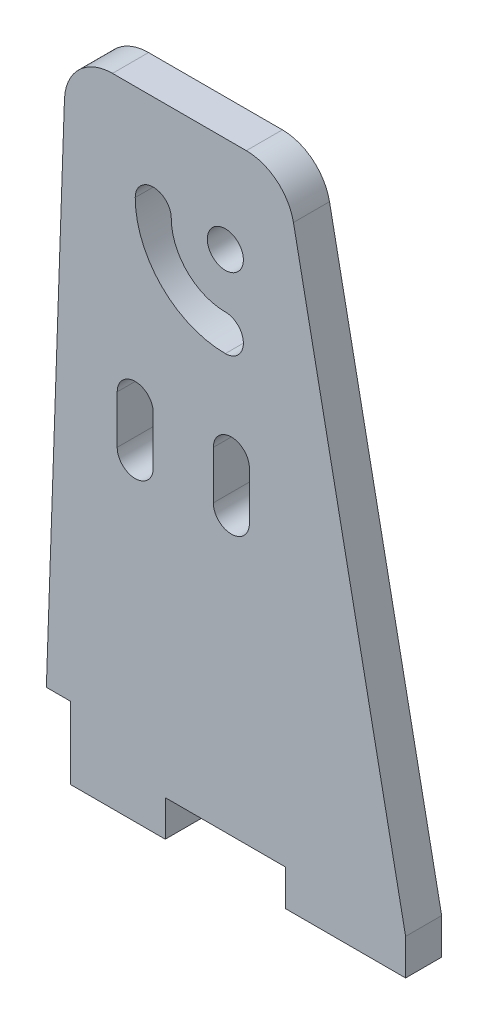
ISO-10303-21;
HEADER;
FILE_DESCRIPTION(('STEP AP214'),'2;1');
FILE_NAME('part.step','',(''),(''),'','','');
FILE_SCHEMA(('AUTOMOTIVE_DESIGN { 1 0 10303 214 1 1 1 1 }'));
ENDSEC;
DATA;
#1=APPLICATION_CONTEXT('core data for automotive mechanical design processes');
#2=APPLICATION_PROTOCOL_DEFINITION('international standard','automotive_design',2000,#1);
#3=PRODUCT_CONTEXT('',#1,'mechanical');
#4=PRODUCT('Part','Part','',(#3));
#5=PRODUCT_RELATED_PRODUCT_CATEGORY('part','',(#4));
#6=PRODUCT_DEFINITION_FORMATION('','',#4);
#7=PRODUCT_DEFINITION_CONTEXT('part definition',#1,'design');
#8=PRODUCT_DEFINITION('design','',#6,#7);
#9=PRODUCT_DEFINITION_SHAPE('','',#8);
#10=(LENGTH_UNIT() NAMED_UNIT(*) SI_UNIT(.MILLI.,.METRE.));
#11=(NAMED_UNIT(*) PLANE_ANGLE_UNIT() SI_UNIT($,.RADIAN.));
#12=(NAMED_UNIT(*) SI_UNIT($,.STERADIAN.) SOLID_ANGLE_UNIT());
#13=UNCERTAINTY_MEASURE_WITH_UNIT(LENGTH_MEASURE(1.E-05),#10,'distance_accuracy_value','');
#14=(GEOMETRIC_REPRESENTATION_CONTEXT(3) GLOBAL_UNCERTAINTY_ASSIGNED_CONTEXT((#13)) GLOBAL_UNIT_ASSIGNED_CONTEXT((#10,
#11,#12)) REPRESENTATION_CONTEXT('',''));
#15=CARTESIAN_POINT('',(0.,0.,0.));
#16=DIRECTION('',(0.,0.,1.));
#17=DIRECTION('',(1.,0.,0.));
#18=AXIS2_PLACEMENT_3D('',#15,#16,#17);
#19=CARTESIAN_POINT('',(-30.8398045570258,22.8317757009346,3.));
#20=DIRECTION('',(0.,0.,-1.));
#21=DIRECTION('',(-1.,0.,0.));
#22=AXIS2_PLACEMENT_3D('',#19,#20,#21);
#23=PLANE('',#22);
#24=CARTESIAN_POINT('',(-28.9485981308411,4.07426117640597,3.));
#25=DIRECTION('',(0.,0.,1.));
#26=DIRECTION('',(1.,0.,0.));
#27=AXIS2_PLACEMENT_3D('',#24,#25,#26);
#28=CIRCLE('',#27,1.5);
#29=CARTESIAN_POINT('',(-27.4485981308411,4.07426117640597,3.));
#30=VERTEX_POINT('',#29);
#31=CARTESIAN_POINT('',(-30.4485981308411,4.07426117640597,3.));
#32=VERTEX_POINT('',#31);
#33=EDGE_CURVE('E256',#30,#32,#28,.T.);
#34=ORIENTED_EDGE('',*,*,#33,.F.);
#35=DIRECTION('',(0.,1.,0.));
#36=VECTOR('',#35,1.);
#37=CARTESIAN_POINT('',(-27.4485981308411,4.07426117640597,3.));
#38=LINE('',#37,#36);
#39=CARTESIAN_POINT('',(-27.4485981308411,0.0742611764059688,3.));
#40=VERTEX_POINT('',#39);
#41=EDGE_CURVE('E264',#40,#30,#38,.T.);
#42=ORIENTED_EDGE('',*,*,#41,.F.);
#43=CARTESIAN_POINT('',(-28.9485981308411,0.0742611764059688,3.));
#44=DIRECTION('',(0.,0.,1.));
#45=DIRECTION('',(1.,0.,0.));
#46=AXIS2_PLACEMENT_3D('',#43,#44,#45);
#47=CIRCLE('',#46,1.5);
#48=CARTESIAN_POINT('',(-30.4485981308411,0.074261176405969,3.));
#49=VERTEX_POINT('',#48);
#50=EDGE_CURVE('E261',#49,#40,#47,.T.);
#51=ORIENTED_EDGE('',*,*,#50,.F.);
#52=DIRECTION('',(0.,-1.,0.));
#53=VECTOR('',#52,1.);
#54=CARTESIAN_POINT('',(-30.4485981308411,4.07426117640597,3.));
#55=LINE('',#54,#53);
#56=EDGE_CURVE('E258',#32,#49,#55,.T.);
#57=ORIENTED_EDGE('',*,*,#56,.F.);
#58=EDGE_LOOP('',(#34,#42,#51,#57));
#59=FACE_BOUND('',#58,.T.);
#60=CARTESIAN_POINT('',(-27.4485981308411,18.8317757009346,3.));
#61=DIRECTION('',(0.,0.,1.));
#62=DIRECTION('',(1.,0.,0.));
#63=AXIS2_PLACEMENT_3D('',#60,#61,#62);
#64=CIRCLE('',#63,1.5);
#65=CARTESIAN_POINT('',(-25.9485981308411,18.8317757009346,3.));
#66=VERTEX_POINT('',#65);
#67=CARTESIAN_POINT('',(-28.9485981308411,18.8317757009346,3.));
#68=VERTEX_POINT('',#67);
#69=EDGE_CURVE('E293',#66,#68,#64,.T.);
#70=ORIENTED_EDGE('',*,*,#69,.F.);
#71=CARTESIAN_POINT('',(-21.4485981308411,18.8317757009346,3.));
#72=DIRECTION('',(0.,0.,-1.));
#73=DIRECTION('',(1.,0.,0.));
#74=AXIS2_PLACEMENT_3D('',#71,#72,#73);
#75=CIRCLE('',#74,4.5);
#76=CARTESIAN_POINT('',(-21.4485981308411,14.3317757009346,3.));
#77=VERTEX_POINT('',#76);
#78=EDGE_CURVE('E301',#77,#66,#75,.T.);
#79=ORIENTED_EDGE('',*,*,#78,.F.);
#80=CARTESIAN_POINT('',(-21.4485981308411,12.8317757009346,3.));
#81=DIRECTION('',(0.,0.,1.));
#82=DIRECTION('',(1.,0.,0.));
#83=AXIS2_PLACEMENT_3D('',#80,#81,#82);
#84=CIRCLE('',#83,1.5);
#85=CARTESIAN_POINT('',(-21.4485981308411,11.3317757009346,3.));
#86=VERTEX_POINT('',#85);
#87=EDGE_CURVE('E298',#86,#77,#84,.T.);
#88=ORIENTED_EDGE('',*,*,#87,.F.);
#89=CARTESIAN_POINT('',(-21.4485981308411,18.8317757009346,3.));
#90=DIRECTION('',(0.,0.,1.));
#91=DIRECTION('',(1.,0.,0.));
#92=AXIS2_PLACEMENT_3D('',#89,#90,#91);
#93=CIRCLE('',#92,7.5);
#94=EDGE_CURVE('E295',#68,#86,#93,.T.);
#95=ORIENTED_EDGE('',*,*,#94,.F.);
#96=EDGE_LOOP('',(#70,#79,#88,#95));
#97=FACE_BOUND('',#96,.T.);
#98=DIRECTION('',(-0.0348994967024937,-0.999390827019096,0.));
#99=VECTOR('',#98,1.);
#100=CARTESIAN_POINT('',(-36.4485981308411,-23.1682242990654,3.));
#101=LINE('',#100,#99);
#102=CARTESIAN_POINT('',(-34.8373678651021,22.9713736877446,3.));
#103=VERTEX_POINT('',#102);
#104=CARTESIAN_POINT('',(-36.3438358223659,-20.1682242990654,3.));
#105=VERTEX_POINT('',#104);
#106=EDGE_CURVE('E327',#103,#105,#101,.T.);
#107=ORIENTED_EDGE('',*,*,#106,.T.);
#108=DIRECTION('',(-1.,0.,0.));
#109=VECTOR('',#108,1.);
#110=CARTESIAN_POINT('',(-34.3438358223659,-20.1682242990654,3.));
#111=LINE('',#110,#109);
#112=CARTESIAN_POINT('',(-34.3438358223659,-20.1682242990654,3.));
#113=VERTEX_POINT('',#112);
#114=EDGE_CURVE('E219',#113,#105,#111,.T.);
#115=ORIENTED_EDGE('',*,*,#114,.F.);
#116=DIRECTION('',(0.,1.,0.));
#117=VECTOR('',#116,1.);
#118=CARTESIAN_POINT('',(-34.3438358223659,-26.1682242990654,3.));
#119=LINE('',#118,#117);
#120=CARTESIAN_POINT('',(-34.3438358223659,-26.1682242990654,3.));
#121=VERTEX_POINT('',#120);
#122=EDGE_CURVE('E201',#121,#113,#119,.T.);
#123=ORIENTED_EDGE('',*,*,#122,.F.);
#124=DIRECTION('',(1.,0.,0.));
#125=VECTOR('',#124,1.);
#126=CARTESIAN_POINT('',(-36.4485981308411,-26.1682242990654,3.));
#127=LINE('',#126,#125);
#128=CARTESIAN_POINT('',(-26.4485981308411,-26.1682242990654,3.));
#129=VERTEX_POINT('',#128);
#130=EDGE_CURVE('E331',#121,#129,#127,.T.);
#131=ORIENTED_EDGE('',*,*,#130,.T.);
#132=DIRECTION('',(0.,1.,0.));
#133=VECTOR('',#132,1.);
#134=CARTESIAN_POINT('',(-26.4485981308411,-26.1682242990654,3.));
#135=LINE('',#134,#133);
#136=CARTESIAN_POINT('',(-26.4485981308411,-23.1682242990654,3.));
#137=VERTEX_POINT('',#136);
#138=EDGE_CURVE('E333',#129,#137,#135,.T.);
#139=ORIENTED_EDGE('',*,*,#138,.T.);
#140=DIRECTION('',(1.,0.,0.));
#141=VECTOR('',#140,1.);
#142=CARTESIAN_POINT('',(-26.4485981308411,-23.1682242990654,3.));
#143=LINE('',#142,#141);
#144=CARTESIAN_POINT('',(-16.4485981308411,-23.1682242990654,3.));
#145=VERTEX_POINT('',#144);
#146=EDGE_CURVE('E335',#137,#145,#143,.T.);
#147=ORIENTED_EDGE('',*,*,#146,.T.);
#148=DIRECTION('',(0.,-1.,0.));
#149=VECTOR('',#148,1.);
#150=CARTESIAN_POINT('',(-16.4485981308411,-23.1682242990654,3.));
#151=LINE('',#150,#149);
#152=CARTESIAN_POINT('',(-16.4485981308411,-26.1682242990654,3.));
#153=VERTEX_POINT('',#152);
#154=EDGE_CURVE('E337',#145,#153,#151,.T.);
#155=ORIENTED_EDGE('',*,*,#154,.T.);
#156=DIRECTION('',(1.,0.,0.));
#157=VECTOR('',#156,1.);
#158=CARTESIAN_POINT('',(-16.4485981308411,-26.1682242990654,3.));
#159=LINE('',#158,#157);
#160=CARTESIAN_POINT('',(-6.4485981308411,-26.1682242990654,3.));
#161=VERTEX_POINT('',#160);
#162=EDGE_CURVE('E339',#153,#161,#159,.T.);
#163=ORIENTED_EDGE('',*,*,#162,.T.);
#164=DIRECTION('',(0.,1.,0.));
#165=VECTOR('',#164,1.);
#166=CARTESIAN_POINT('',(-6.4485981308411,-26.1682242990654,3.));
#167=LINE('',#166,#165);
#168=CARTESIAN_POINT('',(-6.4485981308411,-23.1682242990654,3.));
#169=VERTEX_POINT('',#168);
#170=EDGE_CURVE('E341',#161,#169,#167,.T.);
#171=ORIENTED_EDGE('',*,*,#170,.T.);
#172=DIRECTION('',(-0.195607089177867,0.980682347482283,0.));
#173=VECTOR('',#172,1.);
#174=CARTESIAN_POINT('',(-6.4485981308411,-23.1682242990654,3.));
#175=LINE('',#174,#173);
#176=CARTESIAN_POINT('',(-15.779830266325,23.6142040576461,3.));
#177=VERTEX_POINT('',#176);
#178=EDGE_CURVE('E343',#169,#177,#175,.T.);
#179=ORIENTED_EDGE('',*,*,#178,.T.);
#180=CARTESIAN_POINT('',(-19.7025596562541,22.8317757009346,3.));
#181=DIRECTION('',(0.,0.,1.));
#182=DIRECTION('',(1.,0.,0.));
#183=AXIS2_PLACEMENT_3D('',#180,#181,#182);
#184=CIRCLE('',#183,4.);
#185=CARTESIAN_POINT('',(-19.7025596562541,26.8317757009346,3.));
#186=VERTEX_POINT('',#185);
#187=EDGE_CURVE('E345',#177,#186,#184,.T.);
#188=ORIENTED_EDGE('',*,*,#187,.T.);
#189=DIRECTION('',(-1.,0.,0.));
#190=VECTOR('',#189,1.);
#191=CARTESIAN_POINT('',(-19.7025596562541,26.8317757009346,3.));
#192=LINE('',#191,#190);
#193=CARTESIAN_POINT('',(-30.8398045570258,26.8317757009346,3.));
#194=VERTEX_POINT('',#193);
#195=EDGE_CURVE('E347',#186,#194,#192,.T.);
#196=ORIENTED_EDGE('',*,*,#195,.T.);
#197=CARTESIAN_POINT('',(-30.8398045570258,22.8317757009346,3.));
#198=DIRECTION('',(0.,0.,1.));
#199=DIRECTION('',(-1.,0.,0.));
#200=AXIS2_PLACEMENT_3D('',#197,#198,#199);
#201=CIRCLE('',#200,4.);
#202=EDGE_CURVE('E324',#194,#103,#201,.T.);
#203=ORIENTED_EDGE('',*,*,#202,.T.);
#204=EDGE_LOOP('',(#107,#115,#123,#131,#139,#147,#155,#163,#171,#179,#188,#196,#203));
#205=FACE_BOUND('',#204,.T.);
#206=CARTESIAN_POINT('',(-21.4485981308411,18.8317757009346,3.));
#207=DIRECTION('',(0.,0.,1.));
#208=DIRECTION('',(1.,0.,0.));
#209=AXIS2_PLACEMENT_3D('',#206,#207,#208);
#210=CIRCLE('',#209,1.5);
#211=CARTESIAN_POINT('',(-19.9485981308411,18.8317757009346,3.));
#212=VERTEX_POINT('',#211);
#213=EDGE_CURVE('E287',#212,#212,#210,.T.);
#214=ORIENTED_EDGE('',*,*,#213,.F.);
#215=EDGE_LOOP('',(#214));
#216=FACE_BOUND('',#215,.T.);
#217=CARTESIAN_POINT('',(-20.9485981308411,4.07426117640597,3.));
#218=DIRECTION('',(0.,0.,1.));
#219=DIRECTION('',(1.,0.,0.));
#220=AXIS2_PLACEMENT_3D('',#217,#218,#219);
#221=CIRCLE('',#220,1.5);
#222=CARTESIAN_POINT('',(-19.4485981308411,4.07426117640597,3.));
#223=VERTEX_POINT('',#222);
#224=CARTESIAN_POINT('',(-22.4485981308411,4.07426117640597,3.));
#225=VERTEX_POINT('',#224);
#226=EDGE_CURVE('E227',#223,#225,#221,.T.);
#227=ORIENTED_EDGE('',*,*,#226,.F.);
#228=DIRECTION('',(0.,1.,0.));
#229=VECTOR('',#228,1.);
#230=CARTESIAN_POINT('',(-19.4485981308411,4.07426117640597,3.));
#231=LINE('',#230,#229);
#232=CARTESIAN_POINT('',(-19.4485981308411,0.0742611764059688,3.));
#233=VERTEX_POINT('',#232);
#234=EDGE_CURVE('E234',#233,#223,#231,.T.);
#235=ORIENTED_EDGE('',*,*,#234,.F.);
#236=CARTESIAN_POINT('',(-20.9485981308411,0.0742611764059688,3.));
#237=DIRECTION('',(0.,0.,1.));
#238=DIRECTION('',(1.,0.,0.));
#239=AXIS2_PLACEMENT_3D('',#236,#237,#238);
#240=CIRCLE('',#239,1.5);
#241=CARTESIAN_POINT('',(-22.4485981308411,0.074261176405969,3.));
#242=VERTEX_POINT('',#241);
#243=EDGE_CURVE('E232',#242,#233,#240,.T.);
#244=ORIENTED_EDGE('',*,*,#243,.F.);
#245=DIRECTION('',(0.,-1.,0.));
#246=VECTOR('',#245,1.);
#247=CARTESIAN_POINT('',(-22.4485981308411,4.07426117640597,3.));
#248=LINE('',#247,#246);
#249=EDGE_CURVE('E229',#225,#242,#248,.T.);
#250=ORIENTED_EDGE('',*,*,#249,.F.);
#251=EDGE_LOOP('',(#227,#235,#244,#250));
#252=FACE_BOUND('',#251,.T.);
#253=ADVANCED_FACE('F32',(#59,#97,#205,#216,#252),#23,.F.);
#254=CARTESIAN_POINT('',(-30.8398045570258,22.8317757009346,0.));
#255=DIRECTION('',(0.,0.,-1.));
#256=DIRECTION('',(-1.,0.,0.));
#257=AXIS2_PLACEMENT_3D('',#254,#255,#256);
#258=PLANE('',#257);
#259=DIRECTION('',(-1.,0.,0.));
#260=VECTOR('',#259,1.);
#261=CARTESIAN_POINT('',(-34.3438358223659,-20.1682242990654,0.));
#262=LINE('',#261,#260);
#263=CARTESIAN_POINT('',(-34.3438358223659,-20.1682242990654,0.));
#264=VERTEX_POINT('',#263);
#265=CARTESIAN_POINT('',(-36.3438358223659,-20.1682242990654,0.));
#266=VERTEX_POINT('',#265);
#267=EDGE_CURVE('E208',#264,#266,#262,.T.);
#268=ORIENTED_EDGE('',*,*,#267,.T.);
#269=DIRECTION('',(-0.0348994967024937,-0.999390827019096,0.));
#270=VECTOR('',#269,1.);
#271=CARTESIAN_POINT('',(-36.4485981308411,-23.1682242990654,0.));
#272=LINE('',#271,#270);
#273=CARTESIAN_POINT('',(-34.8373678651021,22.9713736877446,0.));
#274=VERTEX_POINT('',#273);
#275=EDGE_CURVE('E352',#274,#266,#272,.T.);
#276=ORIENTED_EDGE('',*,*,#275,.F.);
#277=CARTESIAN_POINT('',(-30.8398045570258,22.8317757009346,0.));
#278=DIRECTION('',(0.,0.,1.));
#279=DIRECTION('',(-1.,0.,0.));
#280=AXIS2_PLACEMENT_3D('',#277,#278,#279);
#281=CIRCLE('',#280,4.);
#282=CARTESIAN_POINT('',(-30.8398045570258,26.8317757009346,0.));
#283=VERTEX_POINT('',#282);
#284=EDGE_CURVE('E323',#283,#274,#281,.T.);
#285=ORIENTED_EDGE('',*,*,#284,.F.);
#286=DIRECTION('',(-1.,0.,0.));
#287=VECTOR('',#286,1.);
#288=CARTESIAN_POINT('',(-19.7025596562541,26.8317757009346,0.));
#289=LINE('',#288,#287);
#290=CARTESIAN_POINT('',(-19.7025596562541,26.8317757009346,0.));
#291=VERTEX_POINT('',#290);
#292=EDGE_CURVE('E328',#291,#283,#289,.T.);
#293=ORIENTED_EDGE('',*,*,#292,.F.);
#294=CARTESIAN_POINT('',(-19.7025596562541,22.8317757009346,0.));
#295=DIRECTION('',(0.,0.,1.));
#296=DIRECTION('',(1.,0.,0.));
#297=AXIS2_PLACEMENT_3D('',#294,#295,#296);
#298=CIRCLE('',#297,4.);
#299=CARTESIAN_POINT('',(-15.779830266325,23.6142040576461,0.));
#300=VERTEX_POINT('',#299);
#301=EDGE_CURVE('E367',#300,#291,#298,.T.);
#302=ORIENTED_EDGE('',*,*,#301,.F.);
#303=DIRECTION('',(-0.195607089177867,0.980682347482283,0.));
#304=VECTOR('',#303,1.);
#305=CARTESIAN_POINT('',(-6.4485981308411,-23.1682242990654,0.));
#306=LINE('',#305,#304);
#307=CARTESIAN_POINT('',(-6.4485981308411,-23.1682242990654,0.));
#308=VERTEX_POINT('',#307);
#309=EDGE_CURVE('E365',#308,#300,#306,.T.);
#310=ORIENTED_EDGE('',*,*,#309,.F.);
#311=DIRECTION('',(0.,1.,0.));
#312=VECTOR('',#311,1.);
#313=CARTESIAN_POINT('',(-6.4485981308411,-26.1682242990654,0.));
#314=LINE('',#313,#312);
#315=CARTESIAN_POINT('',(-6.4485981308411,-26.1682242990654,0.));
#316=VERTEX_POINT('',#315);
#317=EDGE_CURVE('E363',#316,#308,#314,.T.);
#318=ORIENTED_EDGE('',*,*,#317,.F.);
#319=DIRECTION('',(1.,0.,0.));
#320=VECTOR('',#319,1.);
#321=CARTESIAN_POINT('',(-16.4485981308411,-26.1682242990654,0.));
#322=LINE('',#321,#320);
#323=CARTESIAN_POINT('',(-16.4485981308411,-26.1682242990654,0.));
#324=VERTEX_POINT('',#323);
#325=EDGE_CURVE('E361',#324,#316,#322,.T.);
#326=ORIENTED_EDGE('',*,*,#325,.F.);
#327=DIRECTION('',(0.,-1.,0.));
#328=VECTOR('',#327,1.);
#329=CARTESIAN_POINT('',(-16.4485981308411,-23.1682242990654,0.));
#330=LINE('',#329,#328);
#331=CARTESIAN_POINT('',(-16.4485981308411,-23.1682242990654,0.));
#332=VERTEX_POINT('',#331);
#333=EDGE_CURVE('E359',#332,#324,#330,.T.);
#334=ORIENTED_EDGE('',*,*,#333,.F.);
#335=DIRECTION('',(1.,0.,0.));
#336=VECTOR('',#335,1.);
#337=CARTESIAN_POINT('',(-26.4485981308411,-23.1682242990654,0.));
#338=LINE('',#337,#336);
#339=CARTESIAN_POINT('',(-26.4485981308411,-23.1682242990654,0.));
#340=VERTEX_POINT('',#339);
#341=EDGE_CURVE('E357',#340,#332,#338,.T.);
#342=ORIENTED_EDGE('',*,*,#341,.F.);
#343=DIRECTION('',(0.,1.,0.));
#344=VECTOR('',#343,1.);
#345=CARTESIAN_POINT('',(-26.4485981308411,-26.1682242990654,0.));
#346=LINE('',#345,#344);
#347=CARTESIAN_POINT('',(-26.4485981308411,-26.1682242990654,0.));
#348=VERTEX_POINT('',#347);
#349=EDGE_CURVE('E355',#348,#340,#346,.T.);
#350=ORIENTED_EDGE('',*,*,#349,.F.);
#351=DIRECTION('',(1.,0.,0.));
#352=VECTOR('',#351,1.);
#353=CARTESIAN_POINT('',(-36.4485981308411,-26.1682242990654,0.));
#354=LINE('',#353,#352);
#355=CARTESIAN_POINT('',(-34.3438358223659,-26.1682242990654,0.));
#356=VERTEX_POINT('',#355);
#357=EDGE_CURVE('E218',#356,#348,#354,.T.);
#358=ORIENTED_EDGE('',*,*,#357,.F.);
#359=DIRECTION('',(0.,1.,0.));
#360=VECTOR('',#359,1.);
#361=CARTESIAN_POINT('',(-34.3438358223659,-26.1682242990654,0.));
#362=LINE('',#361,#360);
#363=EDGE_CURVE('E47',#356,#264,#362,.T.);
#364=ORIENTED_EDGE('',*,*,#363,.T.);
#365=EDGE_LOOP('',(#268,#276,#285,#293,#302,#310,#318,#326,#334,#342,#350,#358,#364));
#366=FACE_BOUND('',#365,.T.);
#367=DIRECTION('',(0.,1.,0.));
#368=VECTOR('',#367,1.);
#369=CARTESIAN_POINT('',(-27.4485981308411,4.07426117640597,0.));
#370=LINE('',#369,#368);
#371=CARTESIAN_POINT('',(-27.4485981308411,0.0742611764059688,0.));
#372=VERTEX_POINT('',#371);
#373=CARTESIAN_POINT('',(-27.4485981308411,4.07426117640597,0.));
#374=VERTEX_POINT('',#373);
#375=EDGE_CURVE('E259',#372,#374,#370,.T.);
#376=ORIENTED_EDGE('',*,*,#375,.T.);
#377=CARTESIAN_POINT('',(-28.9485981308411,4.07426117640597,0.));
#378=DIRECTION('',(0.,0.,1.));
#379=DIRECTION('',(1.,0.,0.));
#380=AXIS2_PLACEMENT_3D('',#377,#378,#379);
#381=CIRCLE('',#380,1.5);
#382=CARTESIAN_POINT('',(-30.4485981308411,4.07426117640597,0.));
#383=VERTEX_POINT('',#382);
#384=EDGE_CURVE('E255',#374,#383,#381,.T.);
#385=ORIENTED_EDGE('',*,*,#384,.T.);
#386=DIRECTION('',(0.,-1.,0.));
#387=VECTOR('',#386,1.);
#388=CARTESIAN_POINT('',(-30.4485981308411,4.07426117640597,0.));
#389=LINE('',#388,#387);
#390=CARTESIAN_POINT('',(-30.4485981308411,0.074261176405969,0.));
#391=VERTEX_POINT('',#390);
#392=EDGE_CURVE('E269',#383,#391,#389,.T.);
#393=ORIENTED_EDGE('',*,*,#392,.T.);
#394=CARTESIAN_POINT('',(-28.9485981308411,0.0742611764059688,0.));
#395=DIRECTION('',(0.,0.,1.));
#396=DIRECTION('',(1.,0.,0.));
#397=AXIS2_PLACEMENT_3D('',#394,#395,#396);
#398=CIRCLE('',#397,1.5);
#399=EDGE_CURVE('E272',#391,#372,#398,.T.);
#400=ORIENTED_EDGE('',*,*,#399,.T.);
#401=EDGE_LOOP('',(#376,#385,#393,#400));
#402=FACE_BOUND('',#401,.T.);
#403=CARTESIAN_POINT('',(-21.4485981308411,18.8317757009346,0.));
#404=DIRECTION('',(0.,0.,-1.));
#405=DIRECTION('',(1.,0.,0.));
#406=AXIS2_PLACEMENT_3D('',#403,#404,#405);
#407=CIRCLE('',#406,4.5);
#408=CARTESIAN_POINT('',(-21.4485981308411,14.3317757009346,0.));
#409=VERTEX_POINT('',#408);
#410=CARTESIAN_POINT('',(-25.9485981308411,18.8317757009346,0.));
#411=VERTEX_POINT('',#410);
#412=EDGE_CURVE('E296',#409,#411,#407,.T.);
#413=ORIENTED_EDGE('',*,*,#412,.T.);
#414=CARTESIAN_POINT('',(-27.4485981308411,18.8317757009346,0.));
#415=DIRECTION('',(0.,0.,1.));
#416=DIRECTION('',(1.,0.,0.));
#417=AXIS2_PLACEMENT_3D('',#414,#415,#416);
#418=CIRCLE('',#417,1.5);
#419=CARTESIAN_POINT('',(-28.9485981308411,18.8317757009346,0.));
#420=VERTEX_POINT('',#419);
#421=EDGE_CURVE('E290',#411,#420,#418,.T.);
#422=ORIENTED_EDGE('',*,*,#421,.T.);
#423=CARTESIAN_POINT('',(-21.4485981308411,18.8317757009346,0.));
#424=DIRECTION('',(0.,0.,1.));
#425=DIRECTION('',(1.,0.,0.));
#426=AXIS2_PLACEMENT_3D('',#423,#424,#425);
#427=CIRCLE('',#426,7.5);
#428=CARTESIAN_POINT('',(-21.4485981308411,11.3317757009346,0.));
#429=VERTEX_POINT('',#428);
#430=EDGE_CURVE('E306',#420,#429,#427,.T.);
#431=ORIENTED_EDGE('',*,*,#430,.T.);
#432=CARTESIAN_POINT('',(-21.4485981308411,12.8317757009346,0.));
#433=DIRECTION('',(0.,0.,1.));
#434=DIRECTION('',(1.,0.,0.));
#435=AXIS2_PLACEMENT_3D('',#432,#433,#434);
#436=CIRCLE('',#435,1.5);
#437=EDGE_CURVE('E309',#429,#409,#436,.T.);
#438=ORIENTED_EDGE('',*,*,#437,.T.);
#439=EDGE_LOOP('',(#413,#422,#431,#438));
#440=FACE_BOUND('',#439,.T.);
#441=CARTESIAN_POINT('',(-21.4485981308411,18.8317757009346,0.));
#442=DIRECTION('',(0.,0.,1.));
#443=DIRECTION('',(1.,0.,0.));
#444=AXIS2_PLACEMENT_3D('',#441,#442,#443);
#445=CIRCLE('',#444,1.5);
#446=CARTESIAN_POINT('',(-19.9485981308411,18.8317757009346,0.));
#447=VERTEX_POINT('',#446);
#448=EDGE_CURVE('E286',#447,#447,#445,.T.);
#449=ORIENTED_EDGE('',*,*,#448,.T.);
#450=EDGE_LOOP('',(#449));
#451=FACE_BOUND('',#450,.T.);
#452=DIRECTION('',(0.,1.,0.));
#453=VECTOR('',#452,1.);
#454=CARTESIAN_POINT('',(-19.4485981308411,4.07426117640597,0.));
#455=LINE('',#454,#453);
#456=CARTESIAN_POINT('',(-19.4485981308411,0.0742611764059688,0.));
#457=VERTEX_POINT('',#456);
#458=CARTESIAN_POINT('',(-19.4485981308411,4.07426117640597,0.));
#459=VERTEX_POINT('',#458);
#460=EDGE_CURVE('E230',#457,#459,#455,.T.);
#461=ORIENTED_EDGE('',*,*,#460,.T.);
#462=CARTESIAN_POINT('',(-20.9485981308411,4.07426117640597,0.));
#463=DIRECTION('',(0.,0.,1.));
#464=DIRECTION('',(1.,0.,0.));
#465=AXIS2_PLACEMENT_3D('',#462,#463,#464);
#466=CIRCLE('',#465,1.5);
#467=CARTESIAN_POINT('',(-22.4485981308411,4.07426117640597,0.));
#468=VERTEX_POINT('',#467);
#469=EDGE_CURVE('E224',#459,#468,#466,.T.);
#470=ORIENTED_EDGE('',*,*,#469,.T.);
#471=DIRECTION('',(0.,-1.,0.));
#472=VECTOR('',#471,1.);
#473=CARTESIAN_POINT('',(-22.4485981308411,4.07426117640597,0.));
#474=LINE('',#473,#472);
#475=CARTESIAN_POINT('',(-22.4485981308411,0.074261176405969,0.));
#476=VERTEX_POINT('',#475);
#477=EDGE_CURVE('E239',#468,#476,#474,.T.);
#478=ORIENTED_EDGE('',*,*,#477,.T.);
#479=CARTESIAN_POINT('',(-20.9485981308411,0.0742611764059688,0.));
#480=DIRECTION('',(0.,0.,1.));
#481=DIRECTION('',(1.,0.,0.));
#482=AXIS2_PLACEMENT_3D('',#479,#480,#481);
#483=CIRCLE('',#482,1.5);
#484=EDGE_CURVE('E242',#476,#457,#483,.T.);
#485=ORIENTED_EDGE('',*,*,#484,.T.);
#486=EDGE_LOOP('',(#461,#470,#478,#485));
#487=FACE_BOUND('',#486,.T.);
#488=ADVANCED_FACE('F215',(#366,#402,#440,#451,#487),#258,.T.);
#489=CARTESIAN_POINT('',(-30.8398045570258,22.8317757009346,3.));
#490=DIRECTION('',(0.,0.,-1.));
#491=DIRECTION('',(-1.,0.,0.));
#492=AXIS2_PLACEMENT_3D('',#489,#490,#491);
#493=CYLINDRICAL_SURFACE('',#492,4.);
#494=ORIENTED_EDGE('',*,*,#284,.T.);
#495=DIRECTION('',(0.,0.,-1.));
#496=VECTOR('',#495,1.);
#497=CARTESIAN_POINT('',(-34.8373678651021,22.9713736877446,3.));
#498=LINE('',#497,#496);
#499=EDGE_CURVE('E11',#103,#274,#498,.T.);
#500=ORIENTED_EDGE('',*,*,#499,.F.);
#501=ORIENTED_EDGE('',*,*,#202,.F.);
#502=DIRECTION('',(0.,0.,-1.));
#503=VECTOR('',#502,1.);
#504=CARTESIAN_POINT('',(-30.8398045570258,26.8317757009346,3.));
#505=LINE('',#504,#503);
#506=EDGE_CURVE('E349',#194,#283,#505,.T.);
#507=ORIENTED_EDGE('',*,*,#506,.T.);
#508=EDGE_LOOP('',(#494,#500,#501,#507));
#509=FACE_BOUND('',#508,.T.);
#510=ADVANCED_FACE('F34',(#509),#493,.T.);
#511=CARTESIAN_POINT('',(-36.4485981308411,-23.1682242990654,3.));
#512=DIRECTION('',(0.999390827019096,-0.0348994967024937,0.));
#513=DIRECTION('',(0.0348994967024937,0.999390827019096,0.));
#514=AXIS2_PLACEMENT_3D('',#511,#512,#513);
#515=PLANE('',#514);
#516=ORIENTED_EDGE('',*,*,#275,.T.);
#517=DIRECTION('',(0.,0.,1.));
#518=VECTOR('',#517,1.);
#519=CARTESIAN_POINT('',(-36.3438358223659,-20.1682242990654,0.));
#520=LINE('',#519,#518);
#521=EDGE_CURVE('E204',#266,#105,#520,.T.);
#522=ORIENTED_EDGE('',*,*,#521,.T.);
#523=ORIENTED_EDGE('',*,*,#106,.F.);
#524=ORIENTED_EDGE('',*,*,#499,.T.);
#525=EDGE_LOOP('',(#516,#522,#523,#524));
#526=FACE_BOUND('',#525,.T.);
#527=ADVANCED_FACE('F417',(#526),#515,.F.);
#528=CARTESIAN_POINT('',(-36.4485981308411,-26.1682242990654,3.));
#529=DIRECTION('',(0.,1.,0.));
#530=DIRECTION('',(0.,0.,1.));
#531=AXIS2_PLACEMENT_3D('',#528,#529,#530);
#532=PLANE('',#531);
#533=ORIENTED_EDGE('',*,*,#130,.F.);
#534=DIRECTION('',(0.,0.,1.));
#535=VECTOR('',#534,1.);
#536=CARTESIAN_POINT('',(-34.3438358223659,-26.1682242990654,0.));
#537=LINE('',#536,#535);
#538=EDGE_CURVE('E205',#356,#121,#537,.T.);
#539=ORIENTED_EDGE('',*,*,#538,.F.);
#540=ORIENTED_EDGE('',*,*,#357,.T.);
#541=DIRECTION('',(0.,0.,-1.));
#542=VECTOR('',#541,1.);
#543=CARTESIAN_POINT('',(-26.4485981308411,-26.1682242990654,3.));
#544=LINE('',#543,#542);
#545=EDGE_CURVE('E40',#129,#348,#544,.T.);
#546=ORIENTED_EDGE('',*,*,#545,.F.);
#547=EDGE_LOOP('',(#533,#539,#540,#546));
#548=FACE_BOUND('',#547,.T.);
#549=ADVANCED_FACE('F415',(#548),#532,.F.);
#550=CARTESIAN_POINT('',(-26.4485981308411,-26.1682242990654,3.));
#551=DIRECTION('',(-1.,0.,0.));
#552=DIRECTION('',(0.,0.,1.));
#553=AXIS2_PLACEMENT_3D('',#550,#551,#552);
#554=PLANE('',#553);
#555=ORIENTED_EDGE('',*,*,#349,.T.);
#556=DIRECTION('',(0.,0.,-1.));
#557=VECTOR('',#556,1.);
#558=CARTESIAN_POINT('',(-26.4485981308411,-23.1682242990654,3.));
#559=LINE('',#558,#557);
#560=EDGE_CURVE('E390',#137,#340,#559,.T.);
#561=ORIENTED_EDGE('',*,*,#560,.F.);
#562=ORIENTED_EDGE('',*,*,#138,.F.);
#563=ORIENTED_EDGE('',*,*,#545,.T.);
#564=EDGE_LOOP('',(#555,#561,#562,#563));
#565=FACE_BOUND('',#564,.T.);
#566=ADVANCED_FACE('F396',(#565),#554,.F.);
#567=CARTESIAN_POINT('',(-26.4485981308411,-23.1682242990654,3.));
#568=DIRECTION('',(0.,1.,0.));
#569=DIRECTION('',(0.,0.,1.));
#570=AXIS2_PLACEMENT_3D('',#567,#568,#569);
#571=PLANE('',#570);
#572=ORIENTED_EDGE('',*,*,#341,.T.);
#573=DIRECTION('',(0.,0.,-1.));
#574=VECTOR('',#573,1.);
#575=CARTESIAN_POINT('',(-16.4485981308411,-23.1682242990654,3.));
#576=LINE('',#575,#574);
#577=EDGE_CURVE('E387',#145,#332,#576,.T.);
#578=ORIENTED_EDGE('',*,*,#577,.F.);
#579=ORIENTED_EDGE('',*,*,#146,.F.);
#580=ORIENTED_EDGE('',*,*,#560,.T.);
#581=EDGE_LOOP('',(#572,#578,#579,#580));
#582=FACE_BOUND('',#581,.T.);
#583=ADVANCED_FACE('F405',(#582),#571,.F.);
#584=CARTESIAN_POINT('',(-16.4485981308411,-23.1682242990654,3.));
#585=DIRECTION('',(1.,0.,0.));
#586=DIRECTION('',(0.,0.,-1.));
#587=AXIS2_PLACEMENT_3D('',#584,#585,#586);
#588=PLANE('',#587);
#589=ORIENTED_EDGE('',*,*,#333,.T.);
#590=DIRECTION('',(0.,0.,-1.));
#591=VECTOR('',#590,1.);
#592=CARTESIAN_POINT('',(-16.4485981308411,-26.1682242990654,3.));
#593=LINE('',#592,#591);
#594=EDGE_CURVE('E384',#153,#324,#593,.T.);
#595=ORIENTED_EDGE('',*,*,#594,.F.);
#596=ORIENTED_EDGE('',*,*,#154,.F.);
#597=ORIENTED_EDGE('',*,*,#577,.T.);
#598=EDGE_LOOP('',(#589,#595,#596,#597));
#599=FACE_BOUND('',#598,.T.);
#600=ADVANCED_FACE('F409',(#599),#588,.F.);
#601=CARTESIAN_POINT('',(-16.4485981308411,-26.1682242990654,3.));
#602=DIRECTION('',(0.,1.,0.));
#603=DIRECTION('',(0.,0.,1.));
#604=AXIS2_PLACEMENT_3D('',#601,#602,#603);
#605=PLANE('',#604);
#606=ORIENTED_EDGE('',*,*,#325,.T.);
#607=DIRECTION('',(0.,0.,-1.));
#608=VECTOR('',#607,1.);
#609=CARTESIAN_POINT('',(-6.4485981308411,-26.1682242990654,3.));
#610=LINE('',#609,#608);
#611=EDGE_CURVE('E381',#161,#316,#610,.T.);
#612=ORIENTED_EDGE('',*,*,#611,.F.);
#613=ORIENTED_EDGE('',*,*,#162,.F.);
#614=ORIENTED_EDGE('',*,*,#594,.T.);
#615=EDGE_LOOP('',(#606,#612,#613,#614));
#616=FACE_BOUND('',#615,.T.);
#617=ADVANCED_FACE('F453',(#616),#605,.F.);
#618=CARTESIAN_POINT('',(-6.4485981308411,-26.1682242990654,3.));
#619=DIRECTION('',(-1.,0.,0.));
#620=DIRECTION('',(0.,0.,1.));
#621=AXIS2_PLACEMENT_3D('',#618,#619,#620);
#622=PLANE('',#621);
#623=ORIENTED_EDGE('',*,*,#317,.T.);
#624=DIRECTION('',(0.,0.,-1.));
#625=VECTOR('',#624,1.);
#626=CARTESIAN_POINT('',(-6.4485981308411,-23.1682242990654,3.));
#627=LINE('',#626,#625);
#628=EDGE_CURVE('E378',#169,#308,#627,.T.);
#629=ORIENTED_EDGE('',*,*,#628,.F.);
#630=ORIENTED_EDGE('',*,*,#170,.F.);
#631=ORIENTED_EDGE('',*,*,#611,.T.);
#632=EDGE_LOOP('',(#623,#629,#630,#631));
#633=FACE_BOUND('',#632,.T.);
#634=ADVANCED_FACE('F449',(#633),#622,.F.);
#635=CARTESIAN_POINT('',(-6.4485981308411,-23.1682242990654,3.));
#636=DIRECTION('',(-0.980682347482283,-0.195607089177867,0.));
#637=DIRECTION('',(0.195607089177867,-0.980682347482283,0.));
#638=AXIS2_PLACEMENT_3D('',#635,#636,#637);
#639=PLANE('',#638);
#640=ORIENTED_EDGE('',*,*,#309,.T.);
#641=DIRECTION('',(0.,0.,-1.));
#642=VECTOR('',#641,1.);
#643=CARTESIAN_POINT('',(-15.779830266325,23.6142040576461,3.));
#644=LINE('',#643,#642);
#645=EDGE_CURVE('E375',#177,#300,#644,.T.);
#646=ORIENTED_EDGE('',*,*,#645,.F.);
#647=ORIENTED_EDGE('',*,*,#178,.F.);
#648=ORIENTED_EDGE('',*,*,#628,.T.);
#649=EDGE_LOOP('',(#640,#646,#647,#648));
#650=FACE_BOUND('',#649,.T.);
#651=ADVANCED_FACE('F445',(#650),#639,.F.);
#652=CARTESIAN_POINT('',(-19.7025596562541,22.8317757009346,3.));
#653=DIRECTION('',(0.,0.,-1.));
#654=DIRECTION('',(-1.,0.,0.));
#655=AXIS2_PLACEMENT_3D('',#652,#653,#654);
#656=CYLINDRICAL_SURFACE('',#655,4.);
#657=ORIENTED_EDGE('',*,*,#301,.T.);
#658=DIRECTION('',(0.,0.,-1.));
#659=VECTOR('',#658,1.);
#660=CARTESIAN_POINT('',(-19.7025596562541,26.8317757009346,3.));
#661=LINE('',#660,#659);
#662=EDGE_CURVE('E372',#186,#291,#661,.T.);
#663=ORIENTED_EDGE('',*,*,#662,.F.);
#664=ORIENTED_EDGE('',*,*,#187,.F.);
#665=ORIENTED_EDGE('',*,*,#645,.T.);
#666=EDGE_LOOP('',(#657,#663,#664,#665));
#667=FACE_BOUND('',#666,.T.);
#668=ADVANCED_FACE('F441',(#667),#656,.T.);
#669=CARTESIAN_POINT('',(-19.7025596562541,26.8317757009346,3.));
#670=DIRECTION('',(0.,-1.,0.));
#671=DIRECTION('',(1.,0.,0.));
#672=AXIS2_PLACEMENT_3D('',#669,#670,#671);
#673=PLANE('',#672);
#674=ORIENTED_EDGE('',*,*,#292,.T.);
#675=ORIENTED_EDGE('',*,*,#506,.F.);
#676=ORIENTED_EDGE('',*,*,#195,.F.);
#677=ORIENTED_EDGE('',*,*,#662,.T.);
#678=EDGE_LOOP('',(#674,#675,#676,#677));
#679=FACE_BOUND('',#678,.T.);
#680=ADVANCED_FACE('F438',(#679),#673,.F.);
#681=CARTESIAN_POINT('',(-27.4485981308411,18.8317757009346,3.));
#682=DIRECTION('',(0.,0.,-1.));
#683=DIRECTION('',(-1.,0.,0.));
#684=AXIS2_PLACEMENT_3D('',#681,#682,#683);
#685=CYLINDRICAL_SURFACE('',#684,1.5);
#686=ORIENTED_EDGE('',*,*,#421,.F.);
#687=DIRECTION('',(0.,0.,-1.));
#688=VECTOR('',#687,1.);
#689=CARTESIAN_POINT('',(-25.9485981308411,18.8317757009346,3.));
#690=LINE('',#689,#688);
#691=EDGE_CURVE('E303',#66,#411,#690,.T.);
#692=ORIENTED_EDGE('',*,*,#691,.F.);
#693=ORIENTED_EDGE('',*,*,#69,.T.);
#694=DIRECTION('',(0.,0.,-1.));
#695=VECTOR('',#694,1.);
#696=CARTESIAN_POINT('',(-28.9485981308411,18.8317757009346,3.));
#697=LINE('',#696,#695);
#698=EDGE_CURVE('E320',#68,#420,#697,.T.);
#699=ORIENTED_EDGE('',*,*,#698,.T.);
#700=EDGE_LOOP('',(#686,#692,#693,#699));
#701=FACE_BOUND('',#700,.T.);
#702=ADVANCED_FACE('F435',(#701),#685,.F.);
#703=CARTESIAN_POINT('',(-21.4485981308411,18.8317757009346,3.));
#704=DIRECTION('',(0.,0.,-1.));
#705=DIRECTION('',(-1.,0.,0.));
#706=AXIS2_PLACEMENT_3D('',#703,#704,#705);
#707=CYLINDRICAL_SURFACE('',#706,7.5);
#708=ORIENTED_EDGE('',*,*,#430,.F.);
#709=ORIENTED_EDGE('',*,*,#698,.F.);
#710=ORIENTED_EDGE('',*,*,#94,.T.);
#711=DIRECTION('',(0.,0.,-1.));
#712=VECTOR('',#711,1.);
#713=CARTESIAN_POINT('',(-21.4485981308411,11.3317757009346,3.));
#714=LINE('',#713,#712);
#715=EDGE_CURVE('E318',#86,#429,#714,.T.);
#716=ORIENTED_EDGE('',*,*,#715,.T.);
#717=EDGE_LOOP('',(#708,#709,#710,#716));
#718=FACE_BOUND('',#717,.T.);
#719=ADVANCED_FACE('F495',(#718),#707,.F.);
#720=CARTESIAN_POINT('',(-21.4485981308411,12.8317757009346,3.));
#721=DIRECTION('',(0.,0.,-1.));
#722=DIRECTION('',(-1.,0.,0.));
#723=AXIS2_PLACEMENT_3D('',#720,#721,#722);
#724=CYLINDRICAL_SURFACE('',#723,1.5);
#725=ORIENTED_EDGE('',*,*,#437,.F.);
#726=ORIENTED_EDGE('',*,*,#715,.F.);
#727=ORIENTED_EDGE('',*,*,#87,.T.);
#728=DIRECTION('',(0.,0.,-1.));
#729=VECTOR('',#728,1.);
#730=CARTESIAN_POINT('',(-21.4485981308411,14.3317757009346,3.));
#731=LINE('',#730,#729);
#732=EDGE_CURVE('E316',#77,#409,#731,.T.);
#733=ORIENTED_EDGE('',*,*,#732,.T.);
#734=EDGE_LOOP('',(#725,#726,#727,#733));
#735=FACE_BOUND('',#734,.T.);
#736=ADVANCED_FACE('F502',(#735),#724,.F.);
#737=CARTESIAN_POINT('',(-21.4485981308411,18.8317757009346,3.));
#738=DIRECTION('',(0.,0.,-1.));
#739=DIRECTION('',(-1.,0.,0.));
#740=AXIS2_PLACEMENT_3D('',#737,#738,#739);
#741=CYLINDRICAL_SURFACE('',#740,4.5);
#742=ORIENTED_EDGE('',*,*,#412,.F.);
#743=ORIENTED_EDGE('',*,*,#732,.F.);
#744=ORIENTED_EDGE('',*,*,#78,.T.);
#745=ORIENTED_EDGE('',*,*,#691,.T.);
#746=EDGE_LOOP('',(#742,#743,#744,#745));
#747=FACE_BOUND('',#746,.T.);
#748=ADVANCED_FACE('F509',(#747),#741,.T.);
#749=CARTESIAN_POINT('',(-21.4485981308411,18.8317757009346,3.));
#750=DIRECTION('',(0.,0.,-1.));
#751=DIRECTION('',(-1.,0.,0.));
#752=AXIS2_PLACEMENT_3D('',#749,#750,#751);
#753=CYLINDRICAL_SURFACE('',#752,1.5);
#754=ORIENTED_EDGE('',*,*,#213,.T.);
#755=EDGE_LOOP('',(#754));
#756=FACE_BOUND('',#755,.T.);
#757=ORIENTED_EDGE('',*,*,#448,.F.);
#758=EDGE_LOOP('',(#757));
#759=FACE_BOUND('',#758,.T.);
#760=ADVANCED_FACE('F517',(#756,#759),#753,.F.);
#761=CARTESIAN_POINT('',(-28.9485981308411,4.07426117640597,3.));
#762=DIRECTION('',(0.,0.,-1.));
#763=DIRECTION('',(-1.,0.,0.));
#764=AXIS2_PLACEMENT_3D('',#761,#762,#763);
#765=CYLINDRICAL_SURFACE('',#764,1.5);
#766=ORIENTED_EDGE('',*,*,#384,.F.);
#767=DIRECTION('',(0.,0.,-1.));
#768=VECTOR('',#767,1.);
#769=CARTESIAN_POINT('',(-27.4485981308411,4.07426117640597,3.));
#770=LINE('',#769,#768);
#771=EDGE_CURVE('E266',#30,#374,#770,.T.);
#772=ORIENTED_EDGE('',*,*,#771,.F.);
#773=ORIENTED_EDGE('',*,*,#33,.T.);
#774=DIRECTION('',(0.,0.,-1.));
#775=VECTOR('',#774,1.);
#776=CARTESIAN_POINT('',(-30.4485981308411,4.07426117640597,3.));
#777=LINE('',#776,#775);
#778=EDGE_CURVE('E283',#32,#383,#777,.T.);
#779=ORIENTED_EDGE('',*,*,#778,.T.);
#780=EDGE_LOOP('',(#766,#772,#773,#779));
#781=FACE_BOUND('',#780,.T.);
#782=ADVANCED_FACE('F525',(#781),#765,.F.);
#783=CARTESIAN_POINT('',(-30.4485981308411,4.07426117640597,3.));
#784=DIRECTION('',(1.,0.,0.));
#785=DIRECTION('',(0.,0.,-1.));
#786=AXIS2_PLACEMENT_3D('',#783,#784,#785);
#787=PLANE('',#786);
#788=ORIENTED_EDGE('',*,*,#392,.F.);
#789=ORIENTED_EDGE('',*,*,#778,.F.);
#790=ORIENTED_EDGE('',*,*,#56,.T.);
#791=DIRECTION('',(0.,0.,-1.));
#792=VECTOR('',#791,1.);
#793=CARTESIAN_POINT('',(-30.4485981308411,0.074261176405969,3.));
#794=LINE('',#793,#792);
#795=EDGE_CURVE('E281',#49,#391,#794,.T.);
#796=ORIENTED_EDGE('',*,*,#795,.T.);
#797=EDGE_LOOP('',(#788,#789,#790,#796));
#798=FACE_BOUND('',#797,.T.);
#799=ADVANCED_FACE('F533',(#798),#787,.T.);
#800=CARTESIAN_POINT('',(-28.9485981308411,0.0742611764059688,3.));
#801=DIRECTION('',(0.,0.,-1.));
#802=DIRECTION('',(-1.,0.,0.));
#803=AXIS2_PLACEMENT_3D('',#800,#801,#802);
#804=CYLINDRICAL_SURFACE('',#803,1.5);
#805=ORIENTED_EDGE('',*,*,#399,.F.);
#806=ORIENTED_EDGE('',*,*,#795,.F.);
#807=ORIENTED_EDGE('',*,*,#50,.T.);
#808=DIRECTION('',(0.,0.,-1.));
#809=VECTOR('',#808,1.);
#810=CARTESIAN_POINT('',(-27.4485981308411,0.0742611764059688,3.));
#811=LINE('',#810,#809);
#812=EDGE_CURVE('E279',#40,#372,#811,.T.);
#813=ORIENTED_EDGE('',*,*,#812,.T.);
#814=EDGE_LOOP('',(#805,#806,#807,#813));
#815=FACE_BOUND('',#814,.T.);
#816=ADVANCED_FACE('F541',(#815),#804,.F.);
#817=CARTESIAN_POINT('',(-27.4485981308411,4.07426117640597,3.));
#818=DIRECTION('',(-1.,0.,0.));
#819=DIRECTION('',(0.,0.,1.));
#820=AXIS2_PLACEMENT_3D('',#817,#818,#819);
#821=PLANE('',#820);
#822=ORIENTED_EDGE('',*,*,#375,.F.);
#823=ORIENTED_EDGE('',*,*,#812,.F.);
#824=ORIENTED_EDGE('',*,*,#41,.T.);
#825=ORIENTED_EDGE('',*,*,#771,.T.);
#826=EDGE_LOOP('',(#822,#823,#824,#825));
#827=FACE_BOUND('',#826,.T.);
#828=ADVANCED_FACE('F549',(#827),#821,.T.);
#829=CARTESIAN_POINT('',(-20.9485981308411,4.07426117640597,3.));
#830=DIRECTION('',(0.,0.,-1.));
#831=DIRECTION('',(-1.,0.,0.));
#832=AXIS2_PLACEMENT_3D('',#829,#830,#831);
#833=CYLINDRICAL_SURFACE('',#832,1.5);
#834=ORIENTED_EDGE('',*,*,#469,.F.);
#835=DIRECTION('',(0.,0.,-1.));
#836=VECTOR('',#835,1.);
#837=CARTESIAN_POINT('',(-19.4485981308411,4.07426117640597,3.));
#838=LINE('',#837,#836);
#839=EDGE_CURVE('E236',#223,#459,#838,.T.);
#840=ORIENTED_EDGE('',*,*,#839,.F.);
#841=ORIENTED_EDGE('',*,*,#226,.T.);
#842=DIRECTION('',(0.,0.,-1.));
#843=VECTOR('',#842,1.);
#844=CARTESIAN_POINT('',(-22.4485981308411,4.07426117640597,3.));
#845=LINE('',#844,#843);
#846=EDGE_CURVE('E252',#225,#468,#845,.T.);
#847=ORIENTED_EDGE('',*,*,#846,.T.);
#848=EDGE_LOOP('',(#834,#840,#841,#847));
#849=FACE_BOUND('',#848,.T.);
#850=ADVANCED_FACE('F557',(#849),#833,.F.);
#851=CARTESIAN_POINT('',(-22.4485981308411,4.07426117640597,3.));
#852=DIRECTION('',(1.,0.,0.));
#853=DIRECTION('',(0.,0.,-1.));
#854=AXIS2_PLACEMENT_3D('',#851,#852,#853);
#855=PLANE('',#854);
#856=ORIENTED_EDGE('',*,*,#477,.F.);
#857=ORIENTED_EDGE('',*,*,#846,.F.);
#858=ORIENTED_EDGE('',*,*,#249,.T.);
#859=DIRECTION('',(0.,0.,-1.));
#860=VECTOR('',#859,1.);
#861=CARTESIAN_POINT('',(-22.4485981308411,0.074261176405969,3.));
#862=LINE('',#861,#860);
#863=EDGE_CURVE('E250',#242,#476,#862,.T.);
#864=ORIENTED_EDGE('',*,*,#863,.T.);
#865=EDGE_LOOP('',(#856,#857,#858,#864));
#866=FACE_BOUND('',#865,.T.);
#867=ADVANCED_FACE('F565',(#866),#855,.T.);
#868=CARTESIAN_POINT('',(-20.9485981308411,0.0742611764059688,3.));
#869=DIRECTION('',(0.,0.,-1.));
#870=DIRECTION('',(-1.,0.,0.));
#871=AXIS2_PLACEMENT_3D('',#868,#869,#870);
#872=CYLINDRICAL_SURFACE('',#871,1.5);
#873=ORIENTED_EDGE('',*,*,#484,.F.);
#874=ORIENTED_EDGE('',*,*,#863,.F.);
#875=ORIENTED_EDGE('',*,*,#243,.T.);
#876=DIRECTION('',(0.,0.,-1.));
#877=VECTOR('',#876,1.);
#878=CARTESIAN_POINT('',(-19.4485981308411,0.0742611764059688,3.));
#879=LINE('',#878,#877);
#880=EDGE_CURVE('E55',#233,#457,#879,.T.);
#881=ORIENTED_EDGE('',*,*,#880,.T.);
#882=EDGE_LOOP('',(#873,#874,#875,#881));
#883=FACE_BOUND('',#882,.T.);
#884=ADVANCED_FACE('F573',(#883),#872,.F.);
#885=CARTESIAN_POINT('',(-19.4485981308411,4.07426117640597,3.));
#886=DIRECTION('',(-1.,0.,0.));
#887=DIRECTION('',(0.,0.,1.));
#888=AXIS2_PLACEMENT_3D('',#885,#886,#887);
#889=PLANE('',#888);
#890=ORIENTED_EDGE('',*,*,#460,.F.);
#891=ORIENTED_EDGE('',*,*,#880,.F.);
#892=ORIENTED_EDGE('',*,*,#234,.T.);
#893=ORIENTED_EDGE('',*,*,#839,.T.);
#894=EDGE_LOOP('',(#890,#891,#892,#893));
#895=FACE_BOUND('',#894,.T.);
#896=ADVANCED_FACE('F581',(#895),#889,.T.);
#897=CARTESIAN_POINT('',(-34.3438358223659,-20.1682242990654,0.));
#898=DIRECTION('',(0.,1.,0.));
#899=DIRECTION('',(0.,0.,1.));
#900=AXIS2_PLACEMENT_3D('',#897,#898,#899);
#901=PLANE('',#900);
#902=ORIENTED_EDGE('',*,*,#114,.T.);
#903=ORIENTED_EDGE('',*,*,#521,.F.);
#904=ORIENTED_EDGE('',*,*,#267,.F.);
#905=DIRECTION('',(0.,0.,1.));
#906=VECTOR('',#905,1.);
#907=CARTESIAN_POINT('',(-34.3438358223659,-20.1682242990654,0.));
#908=LINE('',#907,#906);
#909=EDGE_CURVE('E197',#264,#113,#908,.T.);
#910=ORIENTED_EDGE('',*,*,#909,.T.);
#911=EDGE_LOOP('',(#902,#903,#904,#910));
#912=FACE_BOUND('',#911,.T.);
#913=ADVANCED_FACE('F209',(#912),#901,.F.);
#914=CARTESIAN_POINT('',(-34.3438358223659,-26.1682242990654,0.));
#915=DIRECTION('',(1.,0.,0.));
#916=DIRECTION('',(0.,1.,0.));
#917=AXIS2_PLACEMENT_3D('',#914,#915,#916);
#918=PLANE('',#917);
#919=ORIENTED_EDGE('',*,*,#122,.T.);
#920=ORIENTED_EDGE('',*,*,#909,.F.);
#921=ORIENTED_EDGE('',*,*,#363,.F.);
#922=ORIENTED_EDGE('',*,*,#538,.T.);
#923=EDGE_LOOP('',(#919,#920,#921,#922));
#924=FACE_BOUND('',#923,.T.);
#925=ADVANCED_FACE('F199',(#924),#918,.F.);
#926=CLOSED_SHELL('',(#253,#488,#510,#527,#549,#566,#583,#600,#617,#634,#651,#668,#680,#702,
#719,#736,#748,#760,#782,#799,#816,#828,#850,#867,#884,#896,#913,#925));
#927=MANIFOLD_SOLID_BREP('B2',#926);
#928=ADVANCED_BREP_SHAPE_REPRESENTATION('',(#18,#927),#14);
#929=SHAPE_DEFINITION_REPRESENTATION(#9,#928);
ENDSEC;
END-ISO-10303-21;
